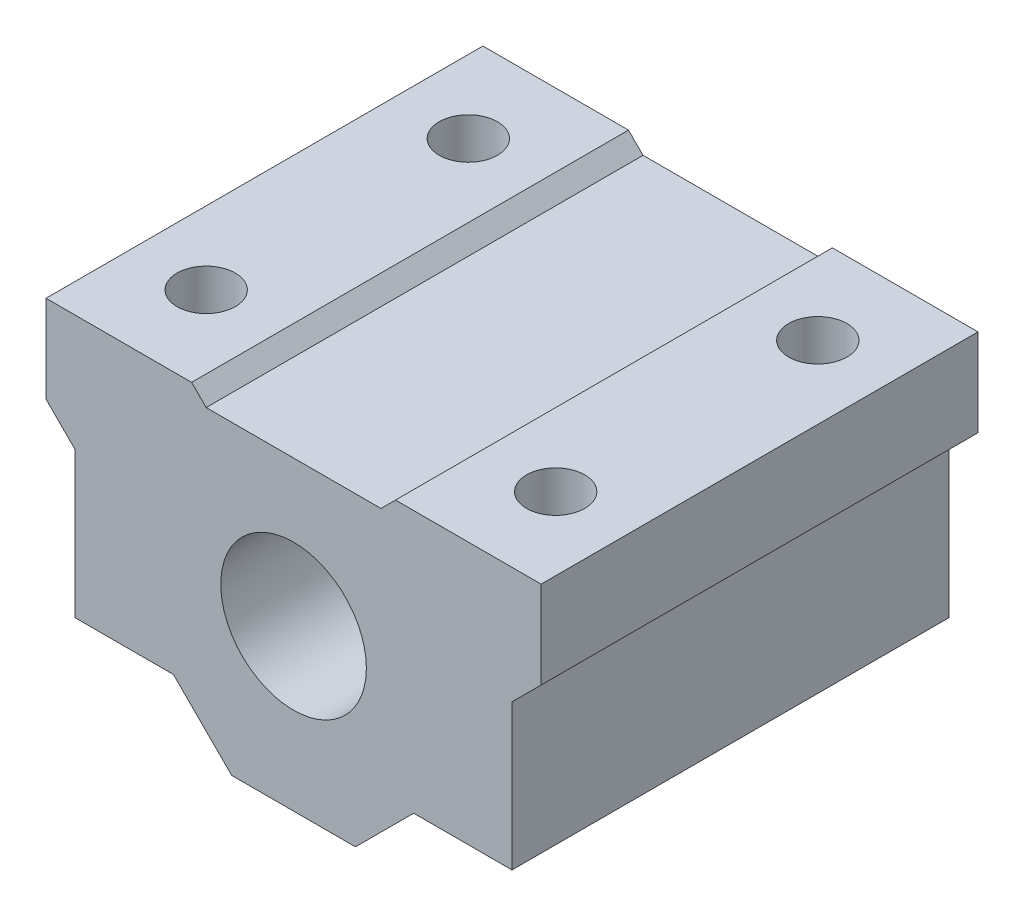
ISO-10303-21;
HEADER;
FILE_DESCRIPTION(('STEP AP214'),'2;1');
FILE_NAME('part.step','',(''),(''),'','','');
FILE_SCHEMA(('AUTOMOTIVE_DESIGN { 1 0 10303 214 1 1 1 1 }'));
ENDSEC;
DATA;
#1=APPLICATION_CONTEXT('core data for automotive mechanical design processes');
#2=APPLICATION_PROTOCOL_DEFINITION('international standard','automotive_design',2000,#1);
#3=PRODUCT_CONTEXT('',#1,'mechanical');
#4=PRODUCT('Part','Part','',(#3));
#5=PRODUCT_RELATED_PRODUCT_CATEGORY('part','',(#4));
#6=PRODUCT_DEFINITION_FORMATION('','',#4);
#7=PRODUCT_DEFINITION_CONTEXT('part definition',#1,'design');
#8=PRODUCT_DEFINITION('design','',#6,#7);
#9=PRODUCT_DEFINITION_SHAPE('','',#8);
#10=(LENGTH_UNIT() NAMED_UNIT(*) SI_UNIT(.MILLI.,.METRE.));
#11=(NAMED_UNIT(*) PLANE_ANGLE_UNIT() SI_UNIT($,.RADIAN.));
#12=(NAMED_UNIT(*) SI_UNIT($,.STERADIAN.) SOLID_ANGLE_UNIT());
#13=UNCERTAINTY_MEASURE_WITH_UNIT(LENGTH_MEASURE(1.E-05),#10,'distance_accuracy_value','');
#14=(GEOMETRIC_REPRESENTATION_CONTEXT(3) GLOBAL_UNCERTAINTY_ASSIGNED_CONTEXT((#13)) GLOBAL_UNIT_ASSIGNED_CONTEXT((#10,
#11,#12)) REPRESENTATION_CONTEXT('',''));
#15=CARTESIAN_POINT('',(0.,0.,0.));
#16=DIRECTION('',(0.,0.,1.));
#17=DIRECTION('',(1.,0.,0.));
#18=AXIS2_PLACEMENT_3D('',#15,#16,#17);
#19=CARTESIAN_POINT('',(12.,11.,9.));
#20=DIRECTION('',(0.,1.,0.));
#21=DIRECTION('',(-1.,0.,0.));
#22=AXIS2_PLACEMENT_3D('',#19,#20,#21);
#23=CYLINDRICAL_SURFACE('',#22,2.);
#24=DIRECTION('',(0.,-1.,0.));
#25=VECTOR('',#24,1.);
#26=CARTESIAN_POINT('',(10.,11.,9.));
#27=LINE('',#26,#25);
#28=CARTESIAN_POINT('',(10.,11.,9.));
#29=VERTEX_POINT('',#28);
#30=CARTESIAN_POINT('',(10.,-7.,9.));
#31=VERTEX_POINT('',#30);
#32=EDGE_CURVE('E11',#29,#31,#27,.T.);
#33=ORIENTED_EDGE('',*,*,#32,.T.);
#34=CARTESIAN_POINT('',(12.,-7.,9.));
#35=DIRECTION('',(0.,1.,0.));
#36=DIRECTION('',(-1.,0.,0.));
#37=AXIS2_PLACEMENT_3D('',#34,#35,#36);
#38=CIRCLE('',#37,2.);
#39=EDGE_CURVE('E209',#31,#31,#38,.T.);
#40=ORIENTED_EDGE('',*,*,#39,.F.);
#41=ORIENTED_EDGE('',*,*,#32,.F.);
#42=CARTESIAN_POINT('',(12.,11.,9.));
#43=DIRECTION('',(0.,1.,0.));
#44=DIRECTION('',(-1.,0.,0.));
#45=AXIS2_PLACEMENT_3D('',#42,#43,#44);
#46=CIRCLE('',#45,2.);
#47=EDGE_CURVE('E211',#29,#29,#46,.T.);
#48=ORIENTED_EDGE('',*,*,#47,.T.);
#49=EDGE_LOOP('',(#33,#40,#41,#48));
#50=FACE_BOUND('',#49,.T.);
#51=ADVANCED_FACE('F16',(#50),#23,.F.);
#52=CARTESIAN_POINT('',(12.,11.,-9.));
#53=DIRECTION('',(0.,1.,0.));
#54=DIRECTION('',(-1.,0.,0.));
#55=AXIS2_PLACEMENT_3D('',#52,#53,#54);
#56=CYLINDRICAL_SURFACE('',#55,2.);
#57=DIRECTION('',(0.,-1.,0.));
#58=VECTOR('',#57,1.);
#59=CARTESIAN_POINT('',(10.,11.,-9.));
#60=LINE('',#59,#58);
#61=CARTESIAN_POINT('',(10.,11.,-9.));
#62=VERTEX_POINT('',#61);
#63=CARTESIAN_POINT('',(10.,-7.,-9.));
#64=VERTEX_POINT('',#63);
#65=EDGE_CURVE('E27',#62,#64,#60,.T.);
#66=ORIENTED_EDGE('',*,*,#65,.T.);
#67=CARTESIAN_POINT('',(12.,-7.,-9.));
#68=DIRECTION('',(0.,1.,0.));
#69=DIRECTION('',(-1.,0.,0.));
#70=AXIS2_PLACEMENT_3D('',#67,#68,#69);
#71=CIRCLE('',#70,2.);
#72=EDGE_CURVE('E217',#64,#64,#71,.T.);
#73=ORIENTED_EDGE('',*,*,#72,.F.);
#74=ORIENTED_EDGE('',*,*,#65,.F.);
#75=CARTESIAN_POINT('',(12.,11.,-9.));
#76=DIRECTION('',(0.,1.,0.));
#77=DIRECTION('',(-1.,0.,0.));
#78=AXIS2_PLACEMENT_3D('',#75,#76,#77);
#79=CIRCLE('',#78,2.);
#80=EDGE_CURVE('E268',#62,#62,#79,.T.);
#81=ORIENTED_EDGE('',*,*,#80,.T.);
#82=EDGE_LOOP('',(#66,#73,#74,#81));
#83=FACE_BOUND('',#82,.T.);
#84=ADVANCED_FACE('F694',(#83),#56,.F.);
#85=CARTESIAN_POINT('',(0.,0.,-15.));
#86=DIRECTION('',(0.,0.,-1.));
#87=DIRECTION('',(1.,0.,0.));
#88=AXIS2_PLACEMENT_3D('',#85,#86,#87);
#89=CYLINDRICAL_SURFACE('',#88,5.);
#90=DIRECTION('',(0.,0.,1.));
#91=VECTOR('',#90,1.);
#92=CARTESIAN_POINT('',(5.,0.,-15.));
#93=LINE('',#92,#91);
#94=CARTESIAN_POINT('',(5.,0.,-15.));
#95=VERTEX_POINT('',#94);
#96=CARTESIAN_POINT('',(5.,0.,15.));
#97=VERTEX_POINT('',#96);
#98=EDGE_CURVE('E247',#95,#97,#93,.T.);
#99=ORIENTED_EDGE('',*,*,#98,.T.);
#100=CARTESIAN_POINT('',(0.,0.,15.));
#101=DIRECTION('',(0.,0.,1.));
#102=DIRECTION('',(1.,0.,0.));
#103=AXIS2_PLACEMENT_3D('',#100,#101,#102);
#104=CIRCLE('',#103,5.);
#105=EDGE_CURVE('E298',#97,#97,#104,.T.);
#106=ORIENTED_EDGE('',*,*,#105,.T.);
#107=ORIENTED_EDGE('',*,*,#98,.F.);
#108=CARTESIAN_POINT('',(0.,0.,-15.));
#109=DIRECTION('',(0.,0.,1.));
#110=DIRECTION('',(1.,0.,0.));
#111=AXIS2_PLACEMENT_3D('',#108,#109,#110);
#112=CIRCLE('',#111,5.);
#113=EDGE_CURVE('E244',#95,#95,#112,.T.);
#114=ORIENTED_EDGE('',*,*,#113,.F.);
#115=EDGE_LOOP('',(#99,#106,#107,#114));
#116=FACE_BOUND('',#115,.T.);
#117=ADVANCED_FACE('F699',(#116),#89,.F.);
#118=CARTESIAN_POINT('',(6.,10.,-15.));
#119=DIRECTION('',(0.,-1.,0.));
#120=DIRECTION('',(0.,0.,-1.));
#121=AXIS2_PLACEMENT_3D('',#118,#119,#120);
#122=PLANE('',#121);
#123=DIRECTION('',(-1.,0.,0.));
#124=VECTOR('',#123,1.);
#125=CARTESIAN_POINT('',(6.,10.,-15.));
#126=LINE('',#125,#124);
#127=CARTESIAN_POINT('',(6.,10.,-15.));
#128=VERTEX_POINT('',#127);
#129=CARTESIAN_POINT('',(-6.,10.,-15.));
#130=VERTEX_POINT('',#129);
#131=EDGE_CURVE('E233',#128,#130,#126,.T.);
#132=ORIENTED_EDGE('',*,*,#131,.T.);
#133=DIRECTION('',(0.,0.,1.));
#134=VECTOR('',#133,1.);
#135=CARTESIAN_POINT('',(-6.,10.,-15.));
#136=LINE('',#135,#134);
#137=CARTESIAN_POINT('',(-6.,10.,15.));
#138=VERTEX_POINT('',#137);
#139=EDGE_CURVE('E295',#130,#138,#136,.T.);
#140=ORIENTED_EDGE('',*,*,#139,.T.);
#141=DIRECTION('',(-1.,0.,0.));
#142=VECTOR('',#141,1.);
#143=CARTESIAN_POINT('',(6.,10.,15.));
#144=LINE('',#143,#142);
#145=CARTESIAN_POINT('',(6.,10.,15.));
#146=VERTEX_POINT('',#145);
#147=EDGE_CURVE('E259',#146,#138,#144,.T.);
#148=ORIENTED_EDGE('',*,*,#147,.F.);
#149=DIRECTION('',(0.,0.,1.));
#150=VECTOR('',#149,1.);
#151=CARTESIAN_POINT('',(6.,10.,-15.));
#152=LINE('',#151,#150);
#153=EDGE_CURVE('E267',#128,#146,#152,.T.);
#154=ORIENTED_EDGE('',*,*,#153,.F.);
#155=EDGE_LOOP('',(#132,#140,#148,#154));
#156=FACE_BOUND('',#155,.T.);
#157=ADVANCED_FACE('F644',(#156),#122,.F.);
#158=CARTESIAN_POINT('',(7.,11.,-15.));
#159=DIRECTION('',(0.707106781186548,-0.707106781186548,0.));
#160=DIRECTION('',(0.,0.,-1.));
#161=AXIS2_PLACEMENT_3D('',#158,#159,#160);
#162=PLANE('',#161);
#163=DIRECTION('',(-0.707106781186548,-0.707106781186548,0.));
#164=VECTOR('',#163,1.);
#165=CARTESIAN_POINT('',(7.,11.,-15.));
#166=LINE('',#165,#164);
#167=CARTESIAN_POINT('',(7.,11.,-15.));
#168=VERTEX_POINT('',#167);
#169=EDGE_CURVE('E237',#168,#128,#166,.T.);
#170=ORIENTED_EDGE('',*,*,#169,.T.);
#171=ORIENTED_EDGE('',*,*,#153,.T.);
#172=DIRECTION('',(-0.707106781186548,-0.707106781186548,0.));
#173=VECTOR('',#172,1.);
#174=CARTESIAN_POINT('',(7.,11.,15.));
#175=LINE('',#174,#173);
#176=CARTESIAN_POINT('',(7.,11.,15.));
#177=VERTEX_POINT('',#176);
#178=EDGE_CURVE('E264',#177,#146,#175,.T.);
#179=ORIENTED_EDGE('',*,*,#178,.F.);
#180=DIRECTION('',(0.,0.,1.));
#181=VECTOR('',#180,1.);
#182=CARTESIAN_POINT('',(7.,11.,-15.));
#183=LINE('',#182,#181);
#184=EDGE_CURVE('E281',#168,#177,#183,.T.);
#185=ORIENTED_EDGE('',*,*,#184,.F.);
#186=EDGE_LOOP('',(#170,#171,#179,#185));
#187=FACE_BOUND('',#186,.T.);
#188=ADVANCED_FACE('F640',(#187),#162,.F.);
#189=CARTESIAN_POINT('',(17.,11.,-15.));
#190=DIRECTION('',(0.,-1.,0.));
#191=DIRECTION('',(0.,0.,-1.));
#192=AXIS2_PLACEMENT_3D('',#189,#190,#191);
#193=PLANE('',#192);
#194=ORIENTED_EDGE('',*,*,#47,.F.);
#195=EDGE_LOOP('',(#194));
#196=FACE_BOUND('',#195,.T.);
#197=ORIENTED_EDGE('',*,*,#80,.F.);
#198=EDGE_LOOP('',(#197));
#199=FACE_BOUND('',#198,.T.);
#200=DIRECTION('',(-1.,0.,0.));
#201=VECTOR('',#200,1.);
#202=CARTESIAN_POINT('',(17.,11.,-15.));
#203=LINE('',#202,#201);
#204=CARTESIAN_POINT('',(17.,11.,-15.));
#205=VERTEX_POINT('',#204);
#206=EDGE_CURVE('E20',#205,#168,#203,.T.);
#207=ORIENTED_EDGE('',*,*,#206,.T.);
#208=ORIENTED_EDGE('',*,*,#184,.T.);
#209=DIRECTION('',(-1.,0.,0.));
#210=VECTOR('',#209,1.);
#211=CARTESIAN_POINT('',(17.,11.,15.));
#212=LINE('',#211,#210);
#213=CARTESIAN_POINT('',(17.,11.,15.));
#214=VERTEX_POINT('',#213);
#215=EDGE_CURVE('E257',#214,#177,#212,.T.);
#216=ORIENTED_EDGE('',*,*,#215,.F.);
#217=DIRECTION('',(0.,0.,1.));
#218=VECTOR('',#217,1.);
#219=CARTESIAN_POINT('',(17.,11.,-15.));
#220=LINE('',#219,#218);
#221=EDGE_CURVE('E316',#205,#214,#220,.T.);
#222=ORIENTED_EDGE('',*,*,#221,.F.);
#223=EDGE_LOOP('',(#207,#208,#216,#222));
#224=FACE_BOUND('',#223,.T.);
#225=ADVANCED_FACE('F622',(#196,#199,#224),#193,.F.);
#226=CARTESIAN_POINT('',(17.,5.,-15.));
#227=DIRECTION('',(-1.,0.,0.));
#228=DIRECTION('',(0.,0.,1.));
#229=AXIS2_PLACEMENT_3D('',#226,#227,#228);
#230=PLANE('',#229);
#231=DIRECTION('',(0.,1.,0.));
#232=VECTOR('',#231,1.);
#233=CARTESIAN_POINT('',(17.,5.,-15.));
#234=LINE('',#233,#232);
#235=CARTESIAN_POINT('',(17.,5.,-15.));
#236=VERTEX_POINT('',#235);
#237=EDGE_CURVE('E403',#236,#205,#234,.T.);
#238=ORIENTED_EDGE('',*,*,#237,.T.);
#239=ORIENTED_EDGE('',*,*,#221,.T.);
#240=DIRECTION('',(0.,1.,0.));
#241=VECTOR('',#240,1.);
#242=CARTESIAN_POINT('',(17.,5.,15.));
#243=LINE('',#242,#241);
#244=CARTESIAN_POINT('',(17.,5.,15.));
#245=VERTEX_POINT('',#244);
#246=EDGE_CURVE('E253',#245,#214,#243,.T.);
#247=ORIENTED_EDGE('',*,*,#246,.F.);
#248=DIRECTION('',(0.,0.,1.));
#249=VECTOR('',#248,1.);
#250=CARTESIAN_POINT('',(17.,5.,-15.));
#251=LINE('',#250,#249);
#252=EDGE_CURVE('E224',#236,#245,#251,.T.);
#253=ORIENTED_EDGE('',*,*,#252,.F.);
#254=EDGE_LOOP('',(#238,#239,#247,#253));
#255=FACE_BOUND('',#254,.T.);
#256=ADVANCED_FACE('F618',(#255),#230,.F.);
#257=CARTESIAN_POINT('',(15.,3.,-15.));
#258=DIRECTION('',(-0.707106781186548,0.707106781186548,0.));
#259=DIRECTION('',(0.,0.,1.));
#260=AXIS2_PLACEMENT_3D('',#257,#258,#259);
#261=PLANE('',#260);
#262=DIRECTION('',(0.707106781186548,0.707106781186548,0.));
#263=VECTOR('',#262,1.);
#264=CARTESIAN_POINT('',(15.,3.,-15.));
#265=LINE('',#264,#263);
#266=CARTESIAN_POINT('',(15.,3.,-15.));
#267=VERTEX_POINT('',#266);
#268=EDGE_CURVE('E308',#267,#236,#265,.T.);
#269=ORIENTED_EDGE('',*,*,#268,.T.);
#270=ORIENTED_EDGE('',*,*,#252,.T.);
#271=DIRECTION('',(0.707106781186548,0.707106781186548,0.));
#272=VECTOR('',#271,1.);
#273=CARTESIAN_POINT('',(15.,3.,15.));
#274=LINE('',#273,#272);
#275=CARTESIAN_POINT('',(15.,3.,15.));
#276=VERTEX_POINT('',#275);
#277=EDGE_CURVE('E258',#276,#245,#274,.T.);
#278=ORIENTED_EDGE('',*,*,#277,.F.);
#279=DIRECTION('',(0.,0.,1.));
#280=VECTOR('',#279,1.);
#281=CARTESIAN_POINT('',(15.,3.,-15.));
#282=LINE('',#281,#280);
#283=EDGE_CURVE('E216',#267,#276,#282,.T.);
#284=ORIENTED_EDGE('',*,*,#283,.F.);
#285=EDGE_LOOP('',(#269,#270,#278,#284));
#286=FACE_BOUND('',#285,.T.);
#287=ADVANCED_FACE('F630',(#286),#261,.F.);
#288=CARTESIAN_POINT('',(15.,-7.,-15.));
#289=DIRECTION('',(-1.,0.,0.));
#290=DIRECTION('',(0.,0.,1.));
#291=AXIS2_PLACEMENT_3D('',#288,#289,#290);
#292=PLANE('',#291);
#293=DIRECTION('',(0.,1.,0.));
#294=VECTOR('',#293,1.);
#295=CARTESIAN_POINT('',(15.,-7.,-15.));
#296=LINE('',#295,#294);
#297=CARTESIAN_POINT('',(15.,-7.,-15.));
#298=VERTEX_POINT('',#297);
#299=EDGE_CURVE('E303',#298,#267,#296,.T.);
#300=ORIENTED_EDGE('',*,*,#299,.T.);
#301=ORIENTED_EDGE('',*,*,#283,.T.);
#302=DIRECTION('',(0.,1.,0.));
#303=VECTOR('',#302,1.);
#304=CARTESIAN_POINT('',(15.,-7.,15.));
#305=LINE('',#304,#303);
#306=CARTESIAN_POINT('',(15.,-7.,15.));
#307=VERTEX_POINT('',#306);
#308=EDGE_CURVE('E273',#307,#276,#305,.T.);
#309=ORIENTED_EDGE('',*,*,#308,.F.);
#310=DIRECTION('',(0.,0.,1.));
#311=VECTOR('',#310,1.);
#312=CARTESIAN_POINT('',(15.,-7.,-15.));
#313=LINE('',#312,#311);
#314=EDGE_CURVE('E227',#298,#307,#313,.T.);
#315=ORIENTED_EDGE('',*,*,#314,.F.);
#316=EDGE_LOOP('',(#300,#301,#309,#315));
#317=FACE_BOUND('',#316,.T.);
#318=ADVANCED_FACE('F672',(#317),#292,.F.);
#319=CARTESIAN_POINT('',(8.25,-7.,-15.));
#320=DIRECTION('',(0.,1.,0.));
#321=DIRECTION('',(1.,0.,0.));
#322=AXIS2_PLACEMENT_3D('',#319,#320,#321);
#323=PLANE('',#322);
#324=ORIENTED_EDGE('',*,*,#39,.T.);
#325=EDGE_LOOP('',(#324));
#326=FACE_BOUND('',#325,.T.);
#327=ORIENTED_EDGE('',*,*,#72,.T.);
#328=EDGE_LOOP('',(#327));
#329=FACE_BOUND('',#328,.T.);
#330=DIRECTION('',(1.,0.,0.));
#331=VECTOR('',#330,1.);
#332=CARTESIAN_POINT('',(8.25,-7.,-15.));
#333=LINE('',#332,#331);
#334=CARTESIAN_POINT('',(8.25,-7.,-15.));
#335=VERTEX_POINT('',#334);
#336=EDGE_CURVE('E307',#335,#298,#333,.T.);
#337=ORIENTED_EDGE('',*,*,#336,.T.);
#338=ORIENTED_EDGE('',*,*,#314,.T.);
#339=DIRECTION('',(1.,0.,0.));
#340=VECTOR('',#339,1.);
#341=CARTESIAN_POINT('',(8.25,-7.,15.));
#342=LINE('',#341,#340);
#343=CARTESIAN_POINT('',(8.25,-7.,15.));
#344=VERTEX_POINT('',#343);
#345=EDGE_CURVE('E277',#344,#307,#342,.T.);
#346=ORIENTED_EDGE('',*,*,#345,.F.);
#347=DIRECTION('',(0.,0.,1.));
#348=VECTOR('',#347,1.);
#349=CARTESIAN_POINT('',(8.25,-7.,-15.));
#350=LINE('',#349,#348);
#351=EDGE_CURVE('E325',#335,#344,#350,.T.);
#352=ORIENTED_EDGE('',*,*,#351,.F.);
#353=EDGE_LOOP('',(#337,#338,#346,#352));
#354=FACE_BOUND('',#353,.T.);
#355=ADVANCED_FACE('F213',(#326,#329,#354),#323,.F.);
#356=CARTESIAN_POINT('',(4.25,-11.,-15.));
#357=DIRECTION('',(-0.707106781186548,0.707106781186548,0.));
#358=DIRECTION('',(0.,0.,1.));
#359=AXIS2_PLACEMENT_3D('',#356,#357,#358);
#360=PLANE('',#359);
#361=DIRECTION('',(0.707106781186548,0.707106781186548,0.));
#362=VECTOR('',#361,1.);
#363=CARTESIAN_POINT('',(4.25,-11.,-15.));
#364=LINE('',#363,#362);
#365=CARTESIAN_POINT('',(4.25,-11.,-15.));
#366=VERTEX_POINT('',#365);
#367=EDGE_CURVE('E231',#366,#335,#364,.T.);
#368=ORIENTED_EDGE('',*,*,#367,.T.);
#369=ORIENTED_EDGE('',*,*,#351,.T.);
#370=DIRECTION('',(0.707106781186548,0.707106781186548,0.));
#371=VECTOR('',#370,1.);
#372=CARTESIAN_POINT('',(4.25,-11.,15.));
#373=LINE('',#372,#371);
#374=CARTESIAN_POINT('',(4.25,-11.,15.));
#375=VERTEX_POINT('',#374);
#376=EDGE_CURVE('E352',#375,#344,#373,.T.);
#377=ORIENTED_EDGE('',*,*,#376,.F.);
#378=DIRECTION('',(0.,0.,1.));
#379=VECTOR('',#378,1.);
#380=CARTESIAN_POINT('',(4.25,-11.,-15.));
#381=LINE('',#380,#379);
#382=EDGE_CURVE('E328',#366,#375,#381,.T.);
#383=ORIENTED_EDGE('',*,*,#382,.F.);
#384=EDGE_LOOP('',(#368,#369,#377,#383));
#385=FACE_BOUND('',#384,.T.);
#386=ADVANCED_FACE('F675',(#385),#360,.F.);
#387=CARTESIAN_POINT('',(-4.25,-11.,-15.));
#388=DIRECTION('',(0.,1.,0.));
#389=DIRECTION('',(1.,0.,0.));
#390=AXIS2_PLACEMENT_3D('',#387,#388,#389);
#391=PLANE('',#390);
#392=DIRECTION('',(1.,0.,0.));
#393=VECTOR('',#392,1.);
#394=CARTESIAN_POINT('',(-4.25,-11.,-15.));
#395=LINE('',#394,#393);
#396=CARTESIAN_POINT('',(-4.25,-11.,-15.));
#397=VERTEX_POINT('',#396);
#398=EDGE_CURVE('E348',#397,#366,#395,.T.);
#399=ORIENTED_EDGE('',*,*,#398,.T.);
#400=ORIENTED_EDGE('',*,*,#382,.T.);
#401=DIRECTION('',(1.,0.,0.));
#402=VECTOR('',#401,1.);
#403=CARTESIAN_POINT('',(-4.25,-11.,15.));
#404=LINE('',#403,#402);
#405=CARTESIAN_POINT('',(-4.25,-11.,15.));
#406=VERTEX_POINT('',#405);
#407=EDGE_CURVE('E294',#406,#375,#404,.T.);
#408=ORIENTED_EDGE('',*,*,#407,.F.);
#409=DIRECTION('',(0.,0.,1.));
#410=VECTOR('',#409,1.);
#411=CARTESIAN_POINT('',(-4.25,-11.,-15.));
#412=LINE('',#411,#410);
#413=EDGE_CURVE('E170',#397,#406,#412,.T.);
#414=ORIENTED_EDGE('',*,*,#413,.F.);
#415=EDGE_LOOP('',(#399,#400,#408,#414));
#416=FACE_BOUND('',#415,.T.);
#417=ADVANCED_FACE('F680',(#416),#391,.F.);
#418=CARTESIAN_POINT('',(-8.25,-7.,-15.));
#419=DIRECTION('',(0.707106781186548,0.707106781186548,0.));
#420=DIRECTION('',(0.,0.,-1.));
#421=AXIS2_PLACEMENT_3D('',#418,#419,#420);
#422=PLANE('',#421);
#423=DIRECTION('',(0.707106781186548,-0.707106781186548,0.));
#424=VECTOR('',#423,1.);
#425=CARTESIAN_POINT('',(-8.25,-7.,-15.));
#426=LINE('',#425,#424);
#427=CARTESIAN_POINT('',(-8.25,-7.,-15.));
#428=VERTEX_POINT('',#427);
#429=EDGE_CURVE('E333',#428,#397,#426,.T.);
#430=ORIENTED_EDGE('',*,*,#429,.T.);
#431=ORIENTED_EDGE('',*,*,#413,.T.);
#432=DIRECTION('',(0.707106781186548,-0.707106781186548,0.));
#433=VECTOR('',#432,1.);
#434=CARTESIAN_POINT('',(-8.25,-7.,15.));
#435=LINE('',#434,#433);
#436=CARTESIAN_POINT('',(-8.25,-7.,15.));
#437=VERTEX_POINT('',#436);
#438=EDGE_CURVE('E290',#437,#406,#435,.T.);
#439=ORIENTED_EDGE('',*,*,#438,.F.);
#440=DIRECTION('',(0.,0.,1.));
#441=VECTOR('',#440,1.);
#442=CARTESIAN_POINT('',(-8.25,-7.,-15.));
#443=LINE('',#442,#441);
#444=EDGE_CURVE('E160',#428,#437,#443,.T.);
#445=ORIENTED_EDGE('',*,*,#444,.F.);
#446=EDGE_LOOP('',(#430,#431,#439,#445));
#447=FACE_BOUND('',#446,.T.);
#448=ADVANCED_FACE('F18',(#447),#422,.F.);
#449=CARTESIAN_POINT('',(-15.,-7.,-15.));
#450=DIRECTION('',(0.,1.,0.));
#451=DIRECTION('',(1.,0.,0.));
#452=AXIS2_PLACEMENT_3D('',#449,#450,#451);
#453=PLANE('',#452);
#454=CARTESIAN_POINT('',(-12.,-7.,-9.));
#455=DIRECTION('',(0.,1.,0.));
#456=DIRECTION('',(-1.,0.,0.));
#457=AXIS2_PLACEMENT_3D('',#454,#455,#456);
#458=CIRCLE('',#457,2.);
#459=CARTESIAN_POINT('',(-14.,-7.,-9.));
#460=VERTEX_POINT('',#459);
#461=EDGE_CURVE('E195',#460,#460,#458,.T.);
#462=ORIENTED_EDGE('',*,*,#461,.T.);
#463=EDGE_LOOP('',(#462));
#464=FACE_BOUND('',#463,.T.);
#465=CARTESIAN_POINT('',(-12.,-7.,9.));
#466=DIRECTION('',(0.,1.,0.));
#467=DIRECTION('',(-1.,0.,0.));
#468=AXIS2_PLACEMENT_3D('',#465,#466,#467);
#469=CIRCLE('',#468,2.);
#470=CARTESIAN_POINT('',(-14.,-7.,9.));
#471=VERTEX_POINT('',#470);
#472=EDGE_CURVE('E204',#471,#471,#469,.T.);
#473=ORIENTED_EDGE('',*,*,#472,.T.);
#474=EDGE_LOOP('',(#473));
#475=FACE_BOUND('',#474,.T.);
#476=DIRECTION('',(1.,0.,0.));
#477=VECTOR('',#476,1.);
#478=CARTESIAN_POINT('',(-15.,-7.,-15.));
#479=LINE('',#478,#477);
#480=CARTESIAN_POINT('',(-15.,-7.,-15.));
#481=VERTEX_POINT('',#480);
#482=EDGE_CURVE('E251',#481,#428,#479,.T.);
#483=ORIENTED_EDGE('',*,*,#482,.T.);
#484=ORIENTED_EDGE('',*,*,#444,.T.);
#485=DIRECTION('',(1.,0.,0.));
#486=VECTOR('',#485,1.);
#487=CARTESIAN_POINT('',(-15.,-7.,15.));
#488=LINE('',#487,#486);
#489=CARTESIAN_POINT('',(-15.,-7.,15.));
#490=VERTEX_POINT('',#489);
#491=EDGE_CURVE('E243',#490,#437,#488,.T.);
#492=ORIENTED_EDGE('',*,*,#491,.F.);
#493=DIRECTION('',(0.,0.,1.));
#494=VECTOR('',#493,1.);
#495=CARTESIAN_POINT('',(-15.,-7.,-15.));
#496=LINE('',#495,#494);
#497=EDGE_CURVE('E271',#481,#490,#496,.T.);
#498=ORIENTED_EDGE('',*,*,#497,.F.);
#499=EDGE_LOOP('',(#483,#484,#492,#498));
#500=FACE_BOUND('',#499,.T.);
#501=ADVANCED_FACE('F681',(#464,#475,#500),#453,.F.);
#502=CARTESIAN_POINT('',(-15.,3.,-15.));
#503=DIRECTION('',(1.,0.,0.));
#504=DIRECTION('',(0.,1.,0.));
#505=AXIS2_PLACEMENT_3D('',#502,#503,#504);
#506=PLANE('',#505);
#507=DIRECTION('',(0.,-1.,0.));
#508=VECTOR('',#507,1.);
#509=CARTESIAN_POINT('',(-15.,3.,-15.));
#510=LINE('',#509,#508);
#511=CARTESIAN_POINT('',(-15.,3.,-15.));
#512=VERTEX_POINT('',#511);
#513=EDGE_CURVE('E248',#512,#481,#510,.T.);
#514=ORIENTED_EDGE('',*,*,#513,.T.);
#515=ORIENTED_EDGE('',*,*,#497,.T.);
#516=DIRECTION('',(0.,-1.,0.));
#517=VECTOR('',#516,1.);
#518=CARTESIAN_POINT('',(-15.,3.,15.));
#519=LINE('',#518,#517);
#520=CARTESIAN_POINT('',(-15.,3.,15.));
#521=VERTEX_POINT('',#520);
#522=EDGE_CURVE('E239',#521,#490,#519,.T.);
#523=ORIENTED_EDGE('',*,*,#522,.F.);
#524=DIRECTION('',(0.,0.,1.));
#525=VECTOR('',#524,1.);
#526=CARTESIAN_POINT('',(-15.,3.,-15.));
#527=LINE('',#526,#525);
#528=EDGE_CURVE('E324',#512,#521,#527,.T.);
#529=ORIENTED_EDGE('',*,*,#528,.F.);
#530=EDGE_LOOP('',(#514,#515,#523,#529));
#531=FACE_BOUND('',#530,.T.);
#532=ADVANCED_FACE('F660',(#531),#506,.F.);
#533=CARTESIAN_POINT('',(-12.,11.,-9.));
#534=DIRECTION('',(0.,1.,0.));
#535=DIRECTION('',(-1.,0.,0.));
#536=AXIS2_PLACEMENT_3D('',#533,#534,#535);
#537=CYLINDRICAL_SURFACE('',#536,2.);
#538=DIRECTION('',(0.,-1.,0.));
#539=VECTOR('',#538,1.);
#540=CARTESIAN_POINT('',(-14.,11.,-9.));
#541=LINE('',#540,#539);
#542=CARTESIAN_POINT('',(-14.,11.,-9.));
#543=VERTEX_POINT('',#542);
#544=EDGE_CURVE('E272',#543,#460,#541,.T.);
#545=ORIENTED_EDGE('',*,*,#544,.T.);
#546=ORIENTED_EDGE('',*,*,#461,.F.);
#547=ORIENTED_EDGE('',*,*,#544,.F.);
#548=CARTESIAN_POINT('',(-12.,11.,-9.));
#549=DIRECTION('',(0.,1.,0.));
#550=DIRECTION('',(-1.,0.,0.));
#551=AXIS2_PLACEMENT_3D('',#548,#549,#550);
#552=CIRCLE('',#551,2.);
#553=EDGE_CURVE('E339',#543,#543,#552,.T.);
#554=ORIENTED_EDGE('',*,*,#553,.T.);
#555=EDGE_LOOP('',(#545,#546,#547,#554));
#556=FACE_BOUND('',#555,.T.);
#557=ADVANCED_FACE('F689',(#556),#537,.F.);
#558=CARTESIAN_POINT('',(-12.,11.,9.));
#559=DIRECTION('',(0.,1.,0.));
#560=DIRECTION('',(-1.,0.,0.));
#561=AXIS2_PLACEMENT_3D('',#558,#559,#560);
#562=CYLINDRICAL_SURFACE('',#561,2.);
#563=DIRECTION('',(0.,-1.,0.));
#564=VECTOR('',#563,1.);
#565=CARTESIAN_POINT('',(-14.,11.,9.));
#566=LINE('',#565,#564);
#567=CARTESIAN_POINT('',(-14.,11.,9.));
#568=VERTEX_POINT('',#567);
#569=EDGE_CURVE('E297',#568,#471,#566,.T.);
#570=ORIENTED_EDGE('',*,*,#569,.T.);
#571=ORIENTED_EDGE('',*,*,#472,.F.);
#572=ORIENTED_EDGE('',*,*,#569,.F.);
#573=CARTESIAN_POINT('',(-12.,11.,9.));
#574=DIRECTION('',(0.,1.,0.));
#575=DIRECTION('',(-1.,0.,0.));
#576=AXIS2_PLACEMENT_3D('',#573,#574,#575);
#577=CIRCLE('',#576,2.);
#578=EDGE_CURVE('E288',#568,#568,#577,.T.);
#579=ORIENTED_EDGE('',*,*,#578,.T.);
#580=EDGE_LOOP('',(#570,#571,#572,#579));
#581=FACE_BOUND('',#580,.T.);
#582=ADVANCED_FACE('F721',(#581),#562,.F.);
#583=CARTESIAN_POINT('',(-6.,10.,-15.));
#584=DIRECTION('',(-0.707106781186548,-0.707106781186548,0.));
#585=DIRECTION('',(-0.707106781186548,0.707106781186548,0.));
#586=AXIS2_PLACEMENT_3D('',#583,#584,#585);
#587=PLANE('',#586);
#588=DIRECTION('',(-0.707106781186548,0.707106781186548,0.));
#589=VECTOR('',#588,1.);
#590=CARTESIAN_POINT('',(-6.,10.,-15.));
#591=LINE('',#590,#589);
#592=CARTESIAN_POINT('',(-7.,11.,-15.));
#593=VERTEX_POINT('',#592);
#594=EDGE_CURVE('E238',#130,#593,#591,.T.);
#595=ORIENTED_EDGE('',*,*,#594,.T.);
#596=DIRECTION('',(0.,0.,1.));
#597=VECTOR('',#596,1.);
#598=CARTESIAN_POINT('',(-7.,11.,-15.));
#599=LINE('',#598,#597);
#600=CARTESIAN_POINT('',(-7.,11.,15.));
#601=VERTEX_POINT('',#600);
#602=EDGE_CURVE('E284',#593,#601,#599,.T.);
#603=ORIENTED_EDGE('',*,*,#602,.T.);
#604=DIRECTION('',(-0.707106781186548,0.707106781186548,0.));
#605=VECTOR('',#604,1.);
#606=CARTESIAN_POINT('',(-6.,10.,15.));
#607=LINE('',#606,#605);
#608=EDGE_CURVE('E263',#138,#601,#607,.T.);
#609=ORIENTED_EDGE('',*,*,#608,.F.);
#610=ORIENTED_EDGE('',*,*,#139,.F.);
#611=EDGE_LOOP('',(#595,#603,#609,#610));
#612=FACE_BOUND('',#611,.T.);
#613=ADVANCED_FACE('F647',(#612),#587,.F.);
#614=CARTESIAN_POINT('',(0.,1.498147813196,15.));
#615=DIRECTION('',(0.,0.,1.));
#616=DIRECTION('',(1.,0.,0.));
#617=AXIS2_PLACEMENT_3D('',#614,#615,#616);
#618=PLANE('',#617);
#619=ORIENTED_EDGE('',*,*,#105,.F.);
#620=EDGE_LOOP('',(#619));
#621=FACE_BOUND('',#620,.T.);
#622=DIRECTION('',(0.,-1.,0.));
#623=VECTOR('',#622,1.);
#624=CARTESIAN_POINT('',(-17.,11.,15.));
#625=LINE('',#624,#623);
#626=CARTESIAN_POINT('',(-17.,11.,15.));
#627=VERTEX_POINT('',#626);
#628=CARTESIAN_POINT('',(-17.,5.,15.));
#629=VERTEX_POINT('',#628);
#630=EDGE_CURVE('E357',#627,#629,#625,.T.);
#631=ORIENTED_EDGE('',*,*,#630,.T.);
#632=DIRECTION('',(0.707106781186548,-0.707106781186548,0.));
#633=VECTOR('',#632,1.);
#634=CARTESIAN_POINT('',(-17.,5.,15.));
#635=LINE('',#634,#633);
#636=EDGE_CURVE('E320',#629,#521,#635,.T.);
#637=ORIENTED_EDGE('',*,*,#636,.T.);
#638=ORIENTED_EDGE('',*,*,#522,.T.);
#639=ORIENTED_EDGE('',*,*,#491,.T.);
#640=ORIENTED_EDGE('',*,*,#438,.T.);
#641=ORIENTED_EDGE('',*,*,#407,.T.);
#642=ORIENTED_EDGE('',*,*,#376,.T.);
#643=ORIENTED_EDGE('',*,*,#345,.T.);
#644=ORIENTED_EDGE('',*,*,#308,.T.);
#645=ORIENTED_EDGE('',*,*,#277,.T.);
#646=ORIENTED_EDGE('',*,*,#246,.T.);
#647=ORIENTED_EDGE('',*,*,#215,.T.);
#648=ORIENTED_EDGE('',*,*,#178,.T.);
#649=ORIENTED_EDGE('',*,*,#147,.T.);
#650=ORIENTED_EDGE('',*,*,#608,.T.);
#651=DIRECTION('',(-1.,0.,0.));
#652=VECTOR('',#651,1.);
#653=CARTESIAN_POINT('',(-7.,11.,15.));
#654=LINE('',#653,#652);
#655=EDGE_CURVE('E289',#601,#627,#654,.T.);
#656=ORIENTED_EDGE('',*,*,#655,.T.);
#657=EDGE_LOOP('',(#631,#637,#638,#639,#640,#641,#642,#643,#644,#645,#646,#647,#648,#649,#650,#656));
#658=FACE_BOUND('',#657,.T.);
#659=ADVANCED_FACE('F626',(#621,#658),#618,.T.);
#660=CARTESIAN_POINT('',(0.,1.498147813196,-15.));
#661=DIRECTION('',(0.,0.,1.));
#662=DIRECTION('',(1.,0.,0.));
#663=AXIS2_PLACEMENT_3D('',#660,#661,#662);
#664=PLANE('',#663);
#665=ORIENTED_EDGE('',*,*,#113,.T.);
#666=EDGE_LOOP('',(#665));
#667=FACE_BOUND('',#666,.T.);
#668=DIRECTION('',(-1.,0.,0.));
#669=VECTOR('',#668,1.);
#670=CARTESIAN_POINT('',(-7.,11.,-15.));
#671=LINE('',#670,#669);
#672=CARTESIAN_POINT('',(-17.,11.,-15.));
#673=VERTEX_POINT('',#672);
#674=EDGE_CURVE('E342',#593,#673,#671,.T.);
#675=ORIENTED_EDGE('',*,*,#674,.F.);
#676=ORIENTED_EDGE('',*,*,#594,.F.);
#677=ORIENTED_EDGE('',*,*,#131,.F.);
#678=ORIENTED_EDGE('',*,*,#169,.F.);
#679=ORIENTED_EDGE('',*,*,#206,.F.);
#680=ORIENTED_EDGE('',*,*,#237,.F.);
#681=ORIENTED_EDGE('',*,*,#268,.F.);
#682=ORIENTED_EDGE('',*,*,#299,.F.);
#683=ORIENTED_EDGE('',*,*,#336,.F.);
#684=ORIENTED_EDGE('',*,*,#367,.F.);
#685=ORIENTED_EDGE('',*,*,#398,.F.);
#686=ORIENTED_EDGE('',*,*,#429,.F.);
#687=ORIENTED_EDGE('',*,*,#482,.F.);
#688=ORIENTED_EDGE('',*,*,#513,.F.);
#689=DIRECTION('',(0.707106781186548,-0.707106781186548,0.));
#690=VECTOR('',#689,1.);
#691=CARTESIAN_POINT('',(-17.,5.,-15.));
#692=LINE('',#691,#690);
#693=CARTESIAN_POINT('',(-17.,5.,-15.));
#694=VERTEX_POINT('',#693);
#695=EDGE_CURVE('E363',#694,#512,#692,.T.);
#696=ORIENTED_EDGE('',*,*,#695,.F.);
#697=DIRECTION('',(0.,-1.,0.));
#698=VECTOR('',#697,1.);
#699=CARTESIAN_POINT('',(-17.,11.,-15.));
#700=LINE('',#699,#698);
#701=EDGE_CURVE('E372',#673,#694,#700,.T.);
#702=ORIENTED_EDGE('',*,*,#701,.F.);
#703=EDGE_LOOP('',(#675,#676,#677,#678,#679,#680,#681,#682,#683,#684,#685,#686,#687,#688,#696,#702));
#704=FACE_BOUND('',#703,.T.);
#705=ADVANCED_FACE('F635',(#667,#704),#664,.F.);
#706=CARTESIAN_POINT('',(-17.,5.,-15.));
#707=DIRECTION('',(0.707106781186548,0.707106781186548,0.));
#708=DIRECTION('',(0.,0.,-1.));
#709=AXIS2_PLACEMENT_3D('',#706,#707,#708);
#710=PLANE('',#709);
#711=ORIENTED_EDGE('',*,*,#695,.T.);
#712=ORIENTED_EDGE('',*,*,#528,.T.);
#713=ORIENTED_EDGE('',*,*,#636,.F.);
#714=DIRECTION('',(0.,0.,1.));
#715=VECTOR('',#714,1.);
#716=CARTESIAN_POINT('',(-17.,5.,-15.));
#717=LINE('',#716,#715);
#718=EDGE_CURVE('E369',#694,#629,#717,.T.);
#719=ORIENTED_EDGE('',*,*,#718,.F.);
#720=EDGE_LOOP('',(#711,#712,#713,#719));
#721=FACE_BOUND('',#720,.T.);
#722=ADVANCED_FACE('F658',(#721),#710,.F.);
#723=CARTESIAN_POINT('',(-7.,11.,-15.));
#724=DIRECTION('',(0.,-1.,0.));
#725=DIRECTION('',(0.,0.,-1.));
#726=AXIS2_PLACEMENT_3D('',#723,#724,#725);
#727=PLANE('',#726);
#728=ORIENTED_EDGE('',*,*,#553,.F.);
#729=EDGE_LOOP('',(#728));
#730=FACE_BOUND('',#729,.T.);
#731=ORIENTED_EDGE('',*,*,#578,.F.);
#732=EDGE_LOOP('',(#731));
#733=FACE_BOUND('',#732,.T.);
#734=ORIENTED_EDGE('',*,*,#674,.T.);
#735=DIRECTION('',(0.,0.,1.));
#736=VECTOR('',#735,1.);
#737=CARTESIAN_POINT('',(-17.,11.,-15.));
#738=LINE('',#737,#736);
#739=EDGE_CURVE('E353',#673,#627,#738,.T.);
#740=ORIENTED_EDGE('',*,*,#739,.T.);
#741=ORIENTED_EDGE('',*,*,#655,.F.);
#742=ORIENTED_EDGE('',*,*,#602,.F.);
#743=EDGE_LOOP('',(#734,#740,#741,#742));
#744=FACE_BOUND('',#743,.T.);
#745=ADVANCED_FACE('F651',(#730,#733,#744),#727,.F.);
#746=CARTESIAN_POINT('',(-17.,11.,-15.));
#747=DIRECTION('',(1.,0.,0.));
#748=DIRECTION('',(0.,1.,0.));
#749=AXIS2_PLACEMENT_3D('',#746,#747,#748);
#750=PLANE('',#749);
#751=ORIENTED_EDGE('',*,*,#701,.T.);
#752=ORIENTED_EDGE('',*,*,#718,.T.);
#753=ORIENTED_EDGE('',*,*,#630,.F.);
#754=ORIENTED_EDGE('',*,*,#739,.F.);
#755=EDGE_LOOP('',(#751,#752,#753,#754));
#756=FACE_BOUND('',#755,.T.);
#757=ADVANCED_FACE('F653',(#756),#750,.F.);
#758=CLOSED_SHELL('',(#51,#84,#117,#157,#188,#225,#256,#287,#318,#355,#386,#417,#448,#501,#532,
#557,#582,#613,#659,#705,#722,#745,#757));
#759=MANIFOLD_SOLID_BREP('B1',#758);
#760=ADVANCED_BREP_SHAPE_REPRESENTATION('',(#18,#759),#14);
#761=SHAPE_DEFINITION_REPRESENTATION(#9,#760);
ENDSEC;
END-ISO-10303-21;
